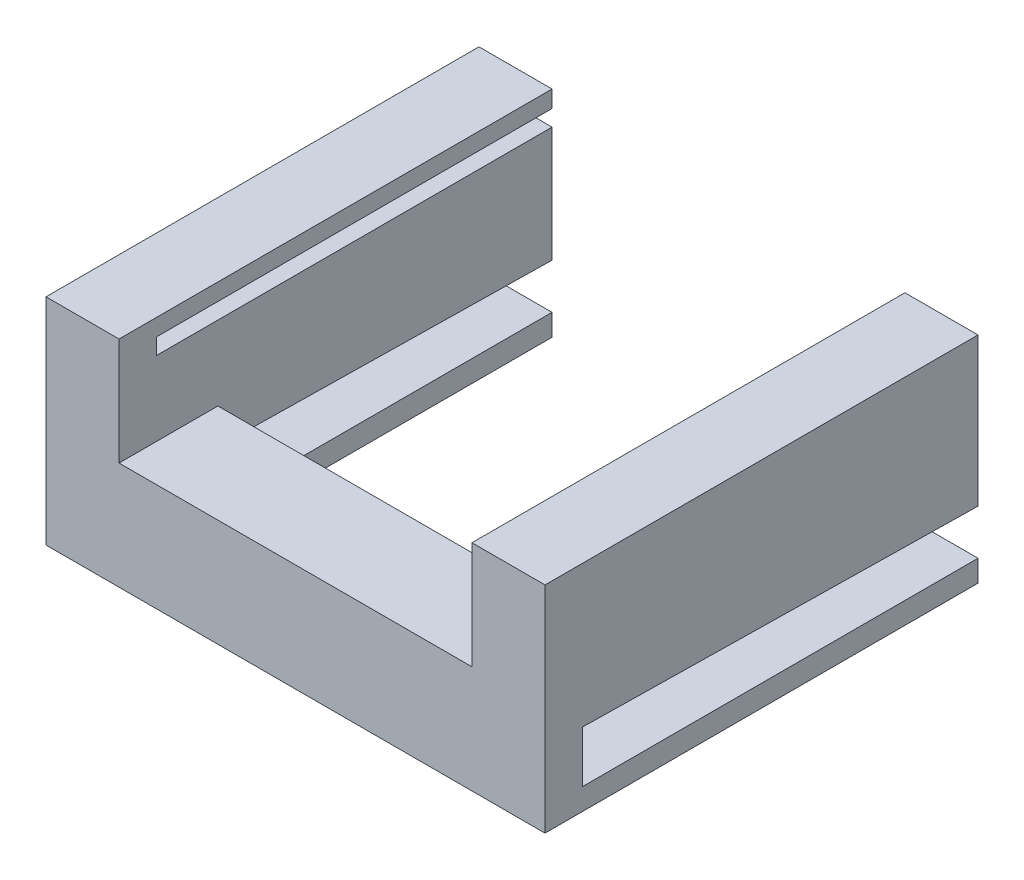
ISO-10303-21;
HEADER;
FILE_DESCRIPTION(('STEP AP214'),'2;1');
FILE_NAME('part.step','',(''),(''),'','','');
FILE_SCHEMA(('AUTOMOTIVE_DESIGN { 1 0 10303 214 1 1 1 1 }'));
ENDSEC;
DATA;
#1=APPLICATION_CONTEXT('core data for automotive mechanical design processes');
#2=APPLICATION_PROTOCOL_DEFINITION('international standard','automotive_design',2000,#1);
#3=PRODUCT_CONTEXT('',#1,'mechanical');
#4=PRODUCT('Part','Part','',(#3));
#5=PRODUCT_RELATED_PRODUCT_CATEGORY('part','',(#4));
#6=PRODUCT_DEFINITION_FORMATION('','',#4);
#7=PRODUCT_DEFINITION_CONTEXT('part definition',#1,'design');
#8=PRODUCT_DEFINITION('design','',#6,#7);
#9=PRODUCT_DEFINITION_SHAPE('','',#8);
#10=(LENGTH_UNIT() NAMED_UNIT(*) SI_UNIT(.MILLI.,.METRE.));
#11=(NAMED_UNIT(*) PLANE_ANGLE_UNIT() SI_UNIT($,.RADIAN.));
#12=(NAMED_UNIT(*) SI_UNIT($,.STERADIAN.) SOLID_ANGLE_UNIT());
#13=UNCERTAINTY_MEASURE_WITH_UNIT(LENGTH_MEASURE(1.E-05),#10,'distance_accuracy_value','');
#14=(GEOMETRIC_REPRESENTATION_CONTEXT(3) GLOBAL_UNCERTAINTY_ASSIGNED_CONTEXT((#13)) GLOBAL_UNIT_ASSIGNED_CONTEXT((#10,
#11,#12)) REPRESENTATION_CONTEXT('',''));
#15=CARTESIAN_POINT('',(0.,0.,0.));
#16=DIRECTION('',(0.,0.,1.));
#17=DIRECTION('',(1.,0.,0.));
#18=AXIS2_PLACEMENT_3D('',#15,#16,#17);
#19=CARTESIAN_POINT('',(0.,22.86,0.));
#20=DIRECTION('',(0.,1.,0.));
#21=DIRECTION('',(0.,0.,1.));
#22=AXIS2_PLACEMENT_3D('',#19,#20,#21);
#23=PLANE('',#22);
#24=DIRECTION('',(-1.,0.,0.));
#25=VECTOR('',#24,1.);
#26=CARTESIAN_POINT('',(0.,22.86,13.9095));
#27=LINE('',#26,#25);
#28=CARTESIAN_POINT('',(20.857,22.86,13.9095));
#29=VERTEX_POINT('',#28);
#30=CARTESIAN_POINT('',(-20.857,22.86,13.9095));
#31=VERTEX_POINT('',#30);
#32=EDGE_CURVE('E352',#29,#31,#27,.T.);
#33=ORIENTED_EDGE('',*,*,#32,.T.);
#34=DIRECTION('',(0.,0.,-1.));
#35=VECTOR('',#34,1.);
#36=CARTESIAN_POINT('',(-20.857,22.86,0.));
#37=LINE('',#36,#35);
#38=CARTESIAN_POINT('',(-20.857,22.86,25.5905));
#39=VERTEX_POINT('',#38);
#40=EDGE_CURVE('E451',#39,#31,#37,.T.);
#41=ORIENTED_EDGE('',*,*,#40,.F.);
#42=DIRECTION('',(-1.,0.,0.));
#43=VECTOR('',#42,1.);
#44=CARTESIAN_POINT('',(0.,22.86,25.5905));
#45=LINE('',#44,#43);
#46=CARTESIAN_POINT('',(20.857,22.86,25.5905));
#47=VERTEX_POINT('',#46);
#48=EDGE_CURVE('E356',#47,#39,#45,.T.);
#49=ORIENTED_EDGE('',*,*,#48,.F.);
#50=DIRECTION('',(0.,0.,-1.));
#51=VECTOR('',#50,1.);
#52=CARTESIAN_POINT('',(20.857,22.86,0.));
#53=LINE('',#52,#51);
#54=EDGE_CURVE('E472',#47,#29,#53,.T.);
#55=ORIENTED_EDGE('',*,*,#54,.T.);
#56=EDGE_LOOP('',(#33,#41,#49,#55));
#57=FACE_BOUND('',#56,.T.);
#58=ADVANCED_FACE('F40',(#57),#23,.T.);
#59=CARTESIAN_POINT('',(0.,22.86,-25.5905));
#60=DIRECTION('',(0.,0.,-1.));
#61=DIRECTION('',(-1.,0.,0.));
#62=AXIS2_PLACEMENT_3D('',#59,#60,#61);
#63=PLANE('',#62);
#64=DIRECTION('',(1.,0.,0.));
#65=VECTOR('',#64,1.);
#66=CARTESIAN_POINT('',(-29.493,10.1464620193215,-25.5905));
#67=LINE('',#66,#65);
#68=CARTESIAN_POINT('',(20.857,10.1464620193215,-25.5905));
#69=VERTEX_POINT('',#68);
#70=CARTESIAN_POINT('',(29.493,10.1464620193215,-25.5905));
#71=VERTEX_POINT('',#70);
#72=EDGE_CURVE('E225',#69,#71,#67,.T.);
#73=ORIENTED_EDGE('',*,*,#72,.F.);
#74=DIRECTION('',(0.,-1.,0.));
#75=VECTOR('',#74,1.);
#76=CARTESIAN_POINT('',(20.857,22.86,-25.5905));
#77=LINE('',#76,#75);
#78=CARTESIAN_POINT('',(20.857,12.7,-25.5905));
#79=VERTEX_POINT('',#78);
#80=EDGE_CURVE('E269',#79,#69,#77,.T.);
#81=ORIENTED_EDGE('',*,*,#80,.F.);
#82=DIRECTION('',(1.,0.,0.));
#83=VECTOR('',#82,1.);
#84=CARTESIAN_POINT('',(-29.493,12.7,-25.5905));
#85=LINE('',#84,#83);
#86=CARTESIAN_POINT('',(29.493,12.7,-25.5905));
#87=VERTEX_POINT('',#86);
#88=EDGE_CURVE('E507',#79,#87,#85,.T.);
#89=ORIENTED_EDGE('',*,*,#88,.T.);
#90=DIRECTION('',(0.,-1.,0.));
#91=VECTOR('',#90,1.);
#92=CARTESIAN_POINT('',(29.493,22.86,-25.5905));
#93=LINE('',#92,#91);
#94=EDGE_CURVE('E360',#87,#71,#93,.T.);
#95=ORIENTED_EDGE('',*,*,#94,.T.);
#96=EDGE_LOOP('',(#73,#81,#89,#95));
#97=FACE_BOUND('',#96,.T.);
#98=ADVANCED_FACE('F523',(#97),#63,.T.);
#99=CARTESIAN_POINT('',(20.857,22.86,0.));
#100=DIRECTION('',(1.,0.,0.));
#101=DIRECTION('',(0.,0.,-1.));
#102=AXIS2_PLACEMENT_3D('',#99,#100,#101);
#103=PLANE('',#102);
#104=ORIENTED_EDGE('',*,*,#80,.T.);
#105=DIRECTION('',(0.,0.,1.));
#106=VECTOR('',#105,1.);
#107=CARTESIAN_POINT('',(20.857,10.1464620193215,0.));
#108=LINE('',#107,#106);
#109=CARTESIAN_POINT('',(20.857,10.1464620193215,13.9095));
#110=VERTEX_POINT('',#109);
#111=EDGE_CURVE('E384',#69,#110,#108,.T.);
#112=ORIENTED_EDGE('',*,*,#111,.T.);
#113=DIRECTION('',(0.,-1.,0.));
#114=VECTOR('',#113,1.);
#115=CARTESIAN_POINT('',(20.857,22.86,13.9095));
#116=LINE('',#115,#114);
#117=CARTESIAN_POINT('',(20.857,12.7,13.9095));
#118=VERTEX_POINT('',#117);
#119=EDGE_CURVE('E264',#118,#110,#116,.T.);
#120=ORIENTED_EDGE('',*,*,#119,.F.);
#121=DIRECTION('',(0.,0.,-1.));
#122=VECTOR('',#121,1.);
#123=CARTESIAN_POINT('',(20.857,12.7,0.));
#124=LINE('',#123,#122);
#125=EDGE_CURVE('E348',#118,#79,#124,.T.);
#126=ORIENTED_EDGE('',*,*,#125,.T.);
#127=EDGE_LOOP('',(#104,#112,#120,#126));
#128=FACE_BOUND('',#127,.T.);
#129=ADVANCED_FACE('F525',(#128),#103,.F.);
#130=CARTESIAN_POINT('',(0.,22.86,13.9095));
#131=DIRECTION('',(0.,0.,1.));
#132=DIRECTION('',(1.,0.,0.));
#133=AXIS2_PLACEMENT_3D('',#130,#131,#132);
#134=PLANE('',#133);
#135=ORIENTED_EDGE('',*,*,#119,.T.);
#136=DIRECTION('',(-1.,0.,0.));
#137=VECTOR('',#136,1.);
#138=CARTESIAN_POINT('',(0.,10.1464620193215,13.9095));
#139=LINE('',#138,#137);
#140=CARTESIAN_POINT('',(-20.857,10.1464620193215,13.9095));
#141=VERTEX_POINT('',#140);
#142=EDGE_CURVE('E380',#110,#141,#139,.T.);
#143=ORIENTED_EDGE('',*,*,#142,.T.);
#144=DIRECTION('',(0.,-1.,0.));
#145=VECTOR('',#144,1.);
#146=CARTESIAN_POINT('',(-20.857,22.86,13.9095));
#147=LINE('',#146,#145);
#148=CARTESIAN_POINT('',(-20.857,12.7,13.9095));
#149=VERTEX_POINT('',#148);
#150=EDGE_CURVE('E258',#149,#141,#147,.T.);
#151=ORIENTED_EDGE('',*,*,#150,.F.);
#152=DIRECTION('',(1.,0.,0.));
#153=VECTOR('',#152,1.);
#154=CARTESIAN_POINT('',(0.,12.7,13.9095));
#155=LINE('',#154,#153);
#156=EDGE_CURVE('E344',#149,#118,#155,.T.);
#157=ORIENTED_EDGE('',*,*,#156,.T.);
#158=EDGE_LOOP('',(#135,#143,#151,#157));
#159=FACE_BOUND('',#158,.T.);
#160=ADVANCED_FACE('F530',(#159),#134,.F.);
#161=CARTESIAN_POINT('',(-20.857,22.86,0.));
#162=DIRECTION('',(1.,0.,0.));
#163=DIRECTION('',(0.,0.,-1.));
#164=AXIS2_PLACEMENT_3D('',#161,#162,#163);
#165=PLANE('',#164);
#166=DIRECTION('',(0.,0.,1.));
#167=VECTOR('',#166,1.);
#168=CARTESIAN_POINT('',(-20.857,10.1464620193215,0.));
#169=LINE('',#168,#167);
#170=CARTESIAN_POINT('',(-20.857,10.1464620193215,-25.5905));
#171=VERTEX_POINT('',#170);
#172=EDGE_CURVE('E388',#171,#141,#169,.T.);
#173=ORIENTED_EDGE('',*,*,#172,.F.);
#174=DIRECTION('',(0.,-1.,0.));
#175=VECTOR('',#174,1.);
#176=CARTESIAN_POINT('',(-20.857,22.86,-25.5905));
#177=LINE('',#176,#175);
#178=CARTESIAN_POINT('',(-20.857,12.7,-25.5905));
#179=VERTEX_POINT('',#178);
#180=EDGE_CURVE('E235',#179,#171,#177,.T.);
#181=ORIENTED_EDGE('',*,*,#180,.F.);
#182=DIRECTION('',(0.,0.,-1.));
#183=VECTOR('',#182,1.);
#184=CARTESIAN_POINT('',(-20.857,12.7,0.));
#185=LINE('',#184,#183);
#186=EDGE_CURVE('E321',#149,#179,#185,.T.);
#187=ORIENTED_EDGE('',*,*,#186,.F.);
#188=ORIENTED_EDGE('',*,*,#150,.T.);
#189=EDGE_LOOP('',(#173,#181,#187,#188));
#190=FACE_BOUND('',#189,.T.);
#191=ADVANCED_FACE('F532',(#190),#165,.T.);
#192=CARTESIAN_POINT('',(0.,22.86,-25.5905));
#193=DIRECTION('',(0.,0.,1.));
#194=DIRECTION('',(1.,0.,0.));
#195=AXIS2_PLACEMENT_3D('',#192,#193,#194);
#196=PLANE('',#195);
#197=ORIENTED_EDGE('',*,*,#180,.T.);
#198=CARTESIAN_POINT('',(-29.493,10.1464620193215,-25.5905));
#199=VERTEX_POINT('',#198);
#200=EDGE_CURVE('E217',#199,#171,#67,.T.);
#201=ORIENTED_EDGE('',*,*,#200,.F.);
#202=DIRECTION('',(0.,-1.,0.));
#203=VECTOR('',#202,1.);
#204=CARTESIAN_POINT('',(-29.493,22.86,-25.5905));
#205=LINE('',#204,#203);
#206=CARTESIAN_POINT('',(-29.493,12.7,-25.5905));
#207=VERTEX_POINT('',#206);
#208=EDGE_CURVE('E233',#207,#199,#205,.T.);
#209=ORIENTED_EDGE('',*,*,#208,.F.);
#210=EDGE_CURVE('E339',#207,#179,#85,.T.);
#211=ORIENTED_EDGE('',*,*,#210,.T.);
#212=EDGE_LOOP('',(#197,#201,#209,#211));
#213=FACE_BOUND('',#212,.T.);
#214=ADVANCED_FACE('F231',(#213),#196,.F.);
#215=DIRECTION('',(-1.,0.,0.));
#216=VECTOR('',#215,1.);
#217=CARTESIAN_POINT('',(24.765,31.66,-25.5905));
#218=LINE('',#217,#216);
#219=CARTESIAN_POINT('',(24.765,31.66,-25.5905));
#220=VERTEX_POINT('',#219);
#221=CARTESIAN_POINT('',(20.857,31.66,-25.5905));
#222=VERTEX_POINT('',#221);
#223=EDGE_CURVE('E402',#220,#222,#218,.T.);
#224=ORIENTED_EDGE('',*,*,#223,.F.);
#225=DIRECTION('',(0.,-1.,0.));
#226=VECTOR('',#225,1.);
#227=CARTESIAN_POINT('',(24.765,31.66,-25.5905));
#228=LINE('',#227,#226);
#229=CARTESIAN_POINT('',(24.765,33.56,-25.5905));
#230=VERTEX_POINT('',#229);
#231=EDGE_CURVE('E390',#230,#220,#228,.T.);
#232=ORIENTED_EDGE('',*,*,#231,.F.);
#233=DIRECTION('',(1.,0.,0.));
#234=VECTOR('',#233,1.);
#235=CARTESIAN_POINT('',(24.765,33.56,-25.5905));
#236=LINE('',#235,#234);
#237=CARTESIAN_POINT('',(20.857,33.56,-25.5905));
#238=VERTEX_POINT('',#237);
#239=EDGE_CURVE('E399',#238,#230,#236,.T.);
#240=ORIENTED_EDGE('',*,*,#239,.F.);
#241=CARTESIAN_POINT('',(20.857,35.56,-25.5905));
#242=VERTEX_POINT('',#241);
#243=EDGE_CURVE('E270',#242,#238,#77,.T.);
#244=ORIENTED_EDGE('',*,*,#243,.F.);
#245=DIRECTION('',(1.,0.,0.));
#246=VECTOR('',#245,1.);
#247=CARTESIAN_POINT('',(0.,35.56,-25.5905));
#248=LINE('',#247,#246);
#249=CARTESIAN_POINT('',(29.493,35.56,-25.5905));
#250=VERTEX_POINT('',#249);
#251=EDGE_CURVE('E475',#242,#250,#248,.T.);
#252=ORIENTED_EDGE('',*,*,#251,.T.);
#253=CARTESIAN_POINT('',(29.493,18.034,-25.5905));
#254=VERTEX_POINT('',#253);
#255=EDGE_CURVE('E325',#250,#254,#93,.T.);
#256=ORIENTED_EDGE('',*,*,#255,.T.);
#257=DIRECTION('',(1.,0.,0.));
#258=VECTOR('',#257,1.);
#259=CARTESIAN_POINT('',(-29.493,18.034,-25.5905));
#260=LINE('',#259,#258);
#261=CARTESIAN_POINT('',(20.857,18.034,-25.5905));
#262=VERTEX_POINT('',#261);
#263=EDGE_CURVE('E316',#262,#254,#260,.T.);
#264=ORIENTED_EDGE('',*,*,#263,.F.);
#265=EDGE_CURVE('E273',#222,#262,#77,.T.);
#266=ORIENTED_EDGE('',*,*,#265,.F.);
#267=EDGE_LOOP('',(#224,#232,#240,#244,#252,#256,#264,#266));
#268=FACE_BOUND('',#267,.T.);
#269=ADVANCED_FACE('F42',(#268),#63,.T.);
#270=DIRECTION('',(0.,-1.,0.));
#271=VECTOR('',#270,1.);
#272=CARTESIAN_POINT('',(20.857,22.86,21.1455));
#273=LINE('',#272,#271);
#274=CARTESIAN_POINT('',(20.857,33.56,21.1455));
#275=VERTEX_POINT('',#274);
#276=CARTESIAN_POINT('',(20.857,31.66,21.1455));
#277=VERTEX_POINT('',#276);
#278=EDGE_CURVE('E448',#275,#277,#273,.T.);
#279=ORIENTED_EDGE('',*,*,#278,.T.);
#280=DIRECTION('',(0.,0.,-1.));
#281=VECTOR('',#280,1.);
#282=CARTESIAN_POINT('',(20.857,31.66,0.));
#283=LINE('',#282,#281);
#284=EDGE_CURVE('E309',#277,#222,#283,.T.);
#285=ORIENTED_EDGE('',*,*,#284,.T.);
#286=ORIENTED_EDGE('',*,*,#265,.T.);
#287=DIRECTION('',(0.,0.0163021811513324,0.99986711061506));
#288=VECTOR('',#287,1.);
#289=CARTESIAN_POINT('',(20.857,18.4524080909494,0.0718629115606079));
#290=LINE('',#289,#288);
#291=CARTESIAN_POINT('',(20.857,18.6780217391304,13.9095));
#292=VERTEX_POINT('',#291);
#293=EDGE_CURVE('E308',#262,#292,#290,.T.);
#294=ORIENTED_EDGE('',*,*,#293,.T.);
#295=EDGE_CURVE('E265',#29,#292,#116,.T.);
#296=ORIENTED_EDGE('',*,*,#295,.F.);
#297=ORIENTED_EDGE('',*,*,#54,.F.);
#298=DIRECTION('',(0.,-1.,0.));
#299=VECTOR('',#298,1.);
#300=CARTESIAN_POINT('',(20.857,35.56,25.5905));
#301=LINE('',#300,#299);
#302=CARTESIAN_POINT('',(20.857,35.56,25.5905));
#303=VERTEX_POINT('',#302);
#304=EDGE_CURVE('E484',#303,#47,#301,.T.);
#305=ORIENTED_EDGE('',*,*,#304,.F.);
#306=DIRECTION('',(0.,0.,-1.));
#307=VECTOR('',#306,1.);
#308=CARTESIAN_POINT('',(20.857,35.56,0.));
#309=LINE('',#308,#307);
#310=EDGE_CURVE('E478',#303,#242,#309,.T.);
#311=ORIENTED_EDGE('',*,*,#310,.T.);
#312=ORIENTED_EDGE('',*,*,#243,.T.);
#313=DIRECTION('',(0.,0.,1.));
#314=VECTOR('',#313,1.);
#315=CARTESIAN_POINT('',(20.857,33.56,0.));
#316=LINE('',#315,#314);
#317=EDGE_CURVE('E440',#238,#275,#316,.T.);
#318=ORIENTED_EDGE('',*,*,#317,.T.);
#319=EDGE_LOOP('',(#279,#285,#286,#294,#296,#297,#305,#311,#312,#318));
#320=FACE_BOUND('',#319,.T.);
#321=ADVANCED_FACE('F306',(#320),#103,.F.);
#322=ORIENTED_EDGE('',*,*,#295,.T.);
#323=DIRECTION('',(-1.,0.,0.));
#324=VECTOR('',#323,1.);
#325=CARTESIAN_POINT('',(0.,18.6780217391304,13.9095));
#326=LINE('',#325,#324);
#327=CARTESIAN_POINT('',(-20.857,18.6780217391304,13.9095));
#328=VERTEX_POINT('',#327);
#329=EDGE_CURVE('E319',#292,#328,#326,.T.);
#330=ORIENTED_EDGE('',*,*,#329,.T.);
#331=EDGE_CURVE('E260',#31,#328,#147,.T.);
#332=ORIENTED_EDGE('',*,*,#331,.F.);
#333=ORIENTED_EDGE('',*,*,#32,.F.);
#334=EDGE_LOOP('',(#322,#330,#332,#333));
#335=FACE_BOUND('',#334,.T.);
#336=ADVANCED_FACE('F593',(#335),#134,.F.);
#337=DIRECTION('',(0.,0.,-1.));
#338=VECTOR('',#337,1.);
#339=CARTESIAN_POINT('',(-20.857,31.66,0.));
#340=LINE('',#339,#338);
#341=CARTESIAN_POINT('',(-20.857,31.66,21.1455));
#342=VERTEX_POINT('',#341);
#343=CARTESIAN_POINT('',(-20.857,31.66,-25.5905));
#344=VERTEX_POINT('',#343);
#345=EDGE_CURVE('E289',#342,#344,#340,.T.);
#346=ORIENTED_EDGE('',*,*,#345,.F.);
#347=DIRECTION('',(0.,-1.,0.));
#348=VECTOR('',#347,1.);
#349=CARTESIAN_POINT('',(-20.857,22.86,21.1455));
#350=LINE('',#349,#348);
#351=CARTESIAN_POINT('',(-20.857,33.56,21.1455));
#352=VERTEX_POINT('',#351);
#353=EDGE_CURVE('E11',#352,#342,#350,.T.);
#354=ORIENTED_EDGE('',*,*,#353,.F.);
#355=DIRECTION('',(0.,0.,1.));
#356=VECTOR('',#355,1.);
#357=CARTESIAN_POINT('',(-20.857,33.56,0.));
#358=LINE('',#357,#356);
#359=CARTESIAN_POINT('',(-20.857,33.56,-25.5905));
#360=VERTEX_POINT('',#359);
#361=EDGE_CURVE('E437',#360,#352,#358,.T.);
#362=ORIENTED_EDGE('',*,*,#361,.F.);
#363=CARTESIAN_POINT('',(-20.857,35.56,-25.5905));
#364=VERTEX_POINT('',#363);
#365=EDGE_CURVE('E254',#364,#360,#177,.T.);
#366=ORIENTED_EDGE('',*,*,#365,.F.);
#367=DIRECTION('',(0.,0.,-1.));
#368=VECTOR('',#367,1.);
#369=CARTESIAN_POINT('',(-20.857,35.56,0.));
#370=LINE('',#369,#368);
#371=CARTESIAN_POINT('',(-20.857,35.56,25.5905));
#372=VERTEX_POINT('',#371);
#373=EDGE_CURVE('E456',#372,#364,#370,.T.);
#374=ORIENTED_EDGE('',*,*,#373,.F.);
#375=DIRECTION('',(0.,-1.,0.));
#376=VECTOR('',#375,1.);
#377=CARTESIAN_POINT('',(-20.857,35.56,25.5905));
#378=LINE('',#377,#376);
#379=EDGE_CURVE('E467',#372,#39,#378,.T.);
#380=ORIENTED_EDGE('',*,*,#379,.T.);
#381=ORIENTED_EDGE('',*,*,#40,.T.);
#382=ORIENTED_EDGE('',*,*,#331,.T.);
#383=DIRECTION('',(0.,0.0163021811513324,0.99986711061506));
#384=VECTOR('',#383,1.);
#385=CARTESIAN_POINT('',(-20.857,18.4524080909494,0.0718629115606079));
#386=LINE('',#385,#384);
#387=CARTESIAN_POINT('',(-20.857,18.034,-25.5905));
#388=VERTEX_POINT('',#387);
#389=EDGE_CURVE('E290',#388,#328,#386,.T.);
#390=ORIENTED_EDGE('',*,*,#389,.F.);
#391=EDGE_CURVE('E259',#344,#388,#177,.T.);
#392=ORIENTED_EDGE('',*,*,#391,.F.);
#393=EDGE_LOOP('',(#346,#354,#362,#366,#374,#380,#381,#382,#390,#392));
#394=FACE_BOUND('',#393,.T.);
#395=ADVANCED_FACE('F287',(#394),#165,.T.);
#396=DIRECTION('',(0.,1.,0.));
#397=VECTOR('',#396,1.);
#398=CARTESIAN_POINT('',(-24.765,31.66,-25.5905));
#399=LINE('',#398,#397);
#400=CARTESIAN_POINT('',(-24.765,31.66,-25.5905));
#401=VERTEX_POINT('',#400);
#402=CARTESIAN_POINT('',(-24.765,33.56,-25.5905));
#403=VERTEX_POINT('',#402);
#404=EDGE_CURVE('E64',#401,#403,#399,.T.);
#405=ORIENTED_EDGE('',*,*,#404,.F.);
#406=DIRECTION('',(1.,0.,0.));
#407=VECTOR('',#406,1.);
#408=CARTESIAN_POINT('',(0.,31.66,-25.5905));
#409=LINE('',#408,#407);
#410=EDGE_CURVE('E49',#401,#344,#409,.T.);
#411=ORIENTED_EDGE('',*,*,#410,.T.);
#412=ORIENTED_EDGE('',*,*,#391,.T.);
#413=CARTESIAN_POINT('',(-29.493,18.034,-25.5905));
#414=VERTEX_POINT('',#413);
#415=EDGE_CURVE('E327',#414,#388,#260,.T.);
#416=ORIENTED_EDGE('',*,*,#415,.F.);
#417=CARTESIAN_POINT('',(-29.493,35.56,-25.5905));
#418=VERTEX_POINT('',#417);
#419=EDGE_CURVE('E244',#418,#414,#205,.T.);
#420=ORIENTED_EDGE('',*,*,#419,.F.);
#421=DIRECTION('',(1.,0.,0.));
#422=VECTOR('',#421,1.);
#423=CARTESIAN_POINT('',(0.,35.56,-25.5905));
#424=LINE('',#423,#422);
#425=EDGE_CURVE('E452',#418,#364,#424,.T.);
#426=ORIENTED_EDGE('',*,*,#425,.T.);
#427=ORIENTED_EDGE('',*,*,#365,.T.);
#428=EDGE_CURVE('E395',#403,#360,#236,.T.);
#429=ORIENTED_EDGE('',*,*,#428,.F.);
#430=EDGE_LOOP('',(#405,#411,#412,#416,#420,#426,#427,#429));
#431=FACE_BOUND('',#430,.T.);
#432=ADVANCED_FACE('F278',(#431),#196,.F.);
#433=CARTESIAN_POINT('',(-29.493,22.86,0.));
#434=DIRECTION('',(1.,0.,0.));
#435=DIRECTION('',(0.,0.,-1.));
#436=AXIS2_PLACEMENT_3D('',#433,#434,#435);
#437=PLANE('',#436);
#438=ORIENTED_EDGE('',*,*,#208,.T.);
#439=DIRECTION('',(0.,0.,1.));
#440=VECTOR('',#439,1.);
#441=CARTESIAN_POINT('',(-29.493,10.1464620193215,25.5905));
#442=LINE('',#441,#440);
#443=CARTESIAN_POINT('',(-29.493,10.1464620193215,25.5905));
#444=VERTEX_POINT('',#443);
#445=EDGE_CURVE('E214',#199,#444,#442,.T.);
#446=ORIENTED_EDGE('',*,*,#445,.T.);
#447=DIRECTION('',(0.,-1.,0.));
#448=VECTOR('',#447,1.);
#449=CARTESIAN_POINT('',(-29.493,22.86,25.5905));
#450=LINE('',#449,#448);
#451=CARTESIAN_POINT('',(-29.493,35.56,25.5905));
#452=VERTEX_POINT('',#451);
#453=EDGE_CURVE('E245',#452,#444,#450,.T.);
#454=ORIENTED_EDGE('',*,*,#453,.F.);
#455=DIRECTION('',(0.,0.,-1.));
#456=VECTOR('',#455,1.);
#457=CARTESIAN_POINT('',(-29.493,35.56,0.));
#458=LINE('',#457,#456);
#459=EDGE_CURVE('E463',#452,#418,#458,.T.);
#460=ORIENTED_EDGE('',*,*,#459,.T.);
#461=ORIENTED_EDGE('',*,*,#419,.T.);
#462=DIRECTION('',(0.,0.0163021811513324,0.99986711061506));
#463=VECTOR('',#462,1.);
#464=CARTESIAN_POINT('',(-29.493,18.796,21.1455));
#465=LINE('',#464,#463);
#466=CARTESIAN_POINT('',(-29.493,18.796,21.1455));
#467=VERTEX_POINT('',#466);
#468=EDGE_CURVE('E491',#414,#467,#465,.T.);
#469=ORIENTED_EDGE('',*,*,#468,.T.);
#470=DIRECTION('',(0.,-1.,0.));
#471=VECTOR('',#470,1.);
#472=CARTESIAN_POINT('',(-29.493,12.7,21.1455));
#473=LINE('',#472,#471);
#474=CARTESIAN_POINT('',(-29.493,12.7,21.1455));
#475=VERTEX_POINT('',#474);
#476=EDGE_CURVE('E332',#467,#475,#473,.T.);
#477=ORIENTED_EDGE('',*,*,#476,.T.);
#478=DIRECTION('',(0.,0.,-1.));
#479=VECTOR('',#478,1.);
#480=CARTESIAN_POINT('',(-29.493,12.7,-25.5905));
#481=LINE('',#480,#479);
#482=EDGE_CURVE('E242',#475,#207,#481,.T.);
#483=ORIENTED_EDGE('',*,*,#482,.T.);
#484=EDGE_LOOP('',(#438,#446,#454,#460,#461,#469,#477,#483));
#485=FACE_BOUND('',#484,.T.);
#486=ADVANCED_FACE('F239',(#485),#437,.F.);
#487=CARTESIAN_POINT('',(0.,22.86,25.5905));
#488=DIRECTION('',(0.,0.,1.));
#489=DIRECTION('',(1.,0.,0.));
#490=AXIS2_PLACEMENT_3D('',#487,#488,#489);
#491=PLANE('',#490);
#492=DIRECTION('',(1.,0.,0.));
#493=VECTOR('',#492,1.);
#494=CARTESIAN_POINT('',(-29.493,10.1464620193215,25.5905));
#495=LINE('',#494,#493);
#496=CARTESIAN_POINT('',(29.493,10.1464620193215,25.5905));
#497=VERTEX_POINT('',#496);
#498=EDGE_CURVE('E220',#444,#497,#495,.T.);
#499=ORIENTED_EDGE('',*,*,#498,.T.);
#500=DIRECTION('',(0.,-1.,0.));
#501=VECTOR('',#500,1.);
#502=CARTESIAN_POINT('',(29.493,22.86,25.5905));
#503=LINE('',#502,#501);
#504=CARTESIAN_POINT('',(29.493,35.56,25.5905));
#505=VERTEX_POINT('',#504);
#506=EDGE_CURVE('E250',#505,#497,#503,.T.);
#507=ORIENTED_EDGE('',*,*,#506,.F.);
#508=DIRECTION('',(-1.,0.,0.));
#509=VECTOR('',#508,1.);
#510=CARTESIAN_POINT('',(0.,35.56,25.5905));
#511=LINE('',#510,#509);
#512=EDGE_CURVE('E377',#505,#303,#511,.T.);
#513=ORIENTED_EDGE('',*,*,#512,.T.);
#514=ORIENTED_EDGE('',*,*,#304,.T.);
#515=ORIENTED_EDGE('',*,*,#48,.T.);
#516=ORIENTED_EDGE('',*,*,#379,.F.);
#517=DIRECTION('',(1.,0.,0.));
#518=VECTOR('',#517,1.);
#519=CARTESIAN_POINT('',(0.,35.56,25.5905));
#520=LINE('',#519,#518);
#521=EDGE_CURVE('E460',#452,#372,#520,.T.);
#522=ORIENTED_EDGE('',*,*,#521,.F.);
#523=ORIENTED_EDGE('',*,*,#453,.T.);
#524=EDGE_LOOP('',(#499,#507,#513,#514,#515,#516,#522,#523));
#525=FACE_BOUND('',#524,.T.);
#526=ADVANCED_FACE('F375',(#525),#491,.T.);
#527=CARTESIAN_POINT('',(29.493,22.86,0.));
#528=DIRECTION('',(1.,0.,0.));
#529=DIRECTION('',(0.,0.,-1.));
#530=AXIS2_PLACEMENT_3D('',#527,#528,#529);
#531=PLANE('',#530);
#532=DIRECTION('',(0.,0.,1.));
#533=VECTOR('',#532,1.);
#534=CARTESIAN_POINT('',(29.493,10.1464620193215,25.5905));
#535=LINE('',#534,#533);
#536=EDGE_CURVE('E226',#71,#497,#535,.T.);
#537=ORIENTED_EDGE('',*,*,#536,.F.);
#538=ORIENTED_EDGE('',*,*,#94,.F.);
#539=DIRECTION('',(0.,0.,-1.));
#540=VECTOR('',#539,1.);
#541=CARTESIAN_POINT('',(29.493,12.7,-25.5905));
#542=LINE('',#541,#540);
#543=CARTESIAN_POINT('',(29.493,12.7,21.1455));
#544=VERTEX_POINT('',#543);
#545=EDGE_CURVE('E495',#544,#87,#542,.T.);
#546=ORIENTED_EDGE('',*,*,#545,.F.);
#547=DIRECTION('',(0.,-1.,0.));
#548=VECTOR('',#547,1.);
#549=CARTESIAN_POINT('',(29.493,12.7,21.1455));
#550=LINE('',#549,#548);
#551=CARTESIAN_POINT('',(29.493,18.796,21.1455));
#552=VERTEX_POINT('',#551);
#553=EDGE_CURVE('E500',#552,#544,#550,.T.);
#554=ORIENTED_EDGE('',*,*,#553,.F.);
#555=DIRECTION('',(0.,0.0163021811513324,0.99986711061506));
#556=VECTOR('',#555,1.);
#557=CARTESIAN_POINT('',(29.493,18.796,21.1455));
#558=LINE('',#557,#556);
#559=EDGE_CURVE('E490',#254,#552,#558,.T.);
#560=ORIENTED_EDGE('',*,*,#559,.F.);
#561=ORIENTED_EDGE('',*,*,#255,.F.);
#562=DIRECTION('',(0.,0.,-1.));
#563=VECTOR('',#562,1.);
#564=CARTESIAN_POINT('',(29.493,35.56,0.));
#565=LINE('',#564,#563);
#566=EDGE_CURVE('E371',#505,#250,#565,.T.);
#567=ORIENTED_EDGE('',*,*,#566,.F.);
#568=ORIENTED_EDGE('',*,*,#506,.T.);
#569=EDGE_LOOP('',(#537,#538,#546,#554,#560,#561,#567,#568));
#570=FACE_BOUND('',#569,.T.);
#571=ADVANCED_FACE('F367',(#570),#531,.T.);
#572=CARTESIAN_POINT('',(-29.493,12.7,-25.5905));
#573=DIRECTION('',(0.,-1.,0.));
#574=DIRECTION('',(0.,0.,-1.));
#575=AXIS2_PLACEMENT_3D('',#572,#573,#574);
#576=PLANE('',#575);
#577=ORIENTED_EDGE('',*,*,#156,.F.);
#578=ORIENTED_EDGE('',*,*,#186,.T.);
#579=ORIENTED_EDGE('',*,*,#210,.F.);
#580=ORIENTED_EDGE('',*,*,#482,.F.);
#581=DIRECTION('',(1.,0.,0.));
#582=VECTOR('',#581,1.);
#583=CARTESIAN_POINT('',(-29.493,12.7,21.1455));
#584=LINE('',#583,#582);
#585=EDGE_CURVE('E508',#475,#544,#584,.T.);
#586=ORIENTED_EDGE('',*,*,#585,.T.);
#587=ORIENTED_EDGE('',*,*,#545,.T.);
#588=ORIENTED_EDGE('',*,*,#88,.F.);
#589=ORIENTED_EDGE('',*,*,#125,.F.);
#590=EDGE_LOOP('',(#577,#578,#579,#580,#586,#587,#588,#589));
#591=FACE_BOUND('',#590,.T.);
#592=ADVANCED_FACE('F519',(#591),#576,.F.);
#593=CARTESIAN_POINT('',(-29.493,18.796,21.1455));
#594=DIRECTION('',(0.,0.99986711061506,-0.0163021811513324));
#595=DIRECTION('',(0.,0.0163021811513324,0.99986711061506));
#596=AXIS2_PLACEMENT_3D('',#593,#594,#595);
#597=PLANE('',#596);
#598=ORIENTED_EDGE('',*,*,#263,.T.);
#599=ORIENTED_EDGE('',*,*,#559,.T.);
#600=DIRECTION('',(1.,0.,0.));
#601=VECTOR('',#600,1.);
#602=CARTESIAN_POINT('',(-29.493,18.796,21.1455));
#603=LINE('',#602,#601);
#604=EDGE_CURVE('E331',#467,#552,#603,.T.);
#605=ORIENTED_EDGE('',*,*,#604,.F.);
#606=ORIENTED_EDGE('',*,*,#468,.F.);
#607=ORIENTED_EDGE('',*,*,#415,.T.);
#608=ORIENTED_EDGE('',*,*,#389,.T.);
#609=ORIENTED_EDGE('',*,*,#329,.F.);
#610=ORIENTED_EDGE('',*,*,#293,.F.);
#611=EDGE_LOOP('',(#598,#599,#605,#606,#607,#608,#609,#610));
#612=FACE_BOUND('',#611,.T.);
#613=ADVANCED_FACE('F314',(#612),#597,.F.);
#614=CARTESIAN_POINT('',(-29.493,12.7,21.1455));
#615=DIRECTION('',(0.,0.,1.));
#616=DIRECTION('',(1.,0.,0.));
#617=AXIS2_PLACEMENT_3D('',#614,#615,#616);
#618=PLANE('',#617);
#619=ORIENTED_EDGE('',*,*,#553,.T.);
#620=ORIENTED_EDGE('',*,*,#585,.F.);
#621=ORIENTED_EDGE('',*,*,#476,.F.);
#622=ORIENTED_EDGE('',*,*,#604,.T.);
#623=EDGE_LOOP('',(#619,#620,#621,#622));
#624=FACE_BOUND('',#623,.T.);
#625=ADVANCED_FACE('F516',(#624),#618,.F.);
#626=CARTESIAN_POINT('',(0.,35.56,0.));
#627=DIRECTION('',(0.,-1.,0.));
#628=DIRECTION('',(0.,0.,-1.));
#629=AXIS2_PLACEMENT_3D('',#626,#627,#628);
#630=PLANE('',#629);
#631=ORIENTED_EDGE('',*,*,#566,.T.);
#632=ORIENTED_EDGE('',*,*,#251,.F.);
#633=ORIENTED_EDGE('',*,*,#310,.F.);
#634=ORIENTED_EDGE('',*,*,#512,.F.);
#635=EDGE_LOOP('',(#631,#632,#633,#634));
#636=FACE_BOUND('',#635,.T.);
#637=ADVANCED_FACE('F565',(#636),#630,.F.);
#638=CARTESIAN_POINT('',(0.,35.56,0.));
#639=DIRECTION('',(0.,1.,0.));
#640=DIRECTION('',(0.,0.,1.));
#641=AXIS2_PLACEMENT_3D('',#638,#639,#640);
#642=PLANE('',#641);
#643=ORIENTED_EDGE('',*,*,#425,.F.);
#644=ORIENTED_EDGE('',*,*,#459,.F.);
#645=ORIENTED_EDGE('',*,*,#521,.T.);
#646=ORIENTED_EDGE('',*,*,#373,.T.);
#647=EDGE_LOOP('',(#643,#644,#645,#646));
#648=FACE_BOUND('',#647,.T.);
#649=ADVANCED_FACE('F536',(#648),#642,.T.);
#650=CARTESIAN_POINT('',(24.765,33.56,70.7119291632956));
#651=DIRECTION('',(0.,1.,0.));
#652=DIRECTION('',(-1.,0.,0.));
#653=AXIS2_PLACEMENT_3D('',#650,#651,#652);
#654=PLANE('',#653);
#655=ORIENTED_EDGE('',*,*,#361,.T.);
#656=DIRECTION('',(1.,0.,0.));
#657=VECTOR('',#656,1.);
#658=CARTESIAN_POINT('',(24.765,33.56,21.1455));
#659=LINE('',#658,#657);
#660=CARTESIAN_POINT('',(-24.765,33.56,21.1455));
#661=VERTEX_POINT('',#660);
#662=EDGE_CURVE('E419',#661,#352,#659,.T.);
#663=ORIENTED_EDGE('',*,*,#662,.F.);
#664=DIRECTION('',(0.,0.,-1.));
#665=VECTOR('',#664,1.);
#666=CARTESIAN_POINT('',(-24.765,33.56,70.7119291632956));
#667=LINE('',#666,#665);
#668=EDGE_CURVE('E427',#661,#403,#667,.T.);
#669=ORIENTED_EDGE('',*,*,#668,.T.);
#670=ORIENTED_EDGE('',*,*,#428,.T.);
#671=EDGE_LOOP('',(#655,#663,#669,#670));
#672=FACE_BOUND('',#671,.T.);
#673=ADVANCED_FACE('F542',(#672),#654,.F.);
#674=CARTESIAN_POINT('',(-24.765,31.66,70.7119291632956));
#675=DIRECTION('',(-1.,0.,0.));
#676=DIRECTION('',(0.,0.,1.));
#677=AXIS2_PLACEMENT_3D('',#674,#675,#676);
#678=PLANE('',#677);
#679=DIRECTION('',(0.,0.,-1.));
#680=VECTOR('',#679,1.);
#681=CARTESIAN_POINT('',(-24.765,31.66,70.7119291632956));
#682=LINE('',#681,#680);
#683=CARTESIAN_POINT('',(-24.765,31.66,21.1455));
#684=VERTEX_POINT('',#683);
#685=EDGE_CURVE('E412',#684,#401,#682,.T.);
#686=ORIENTED_EDGE('',*,*,#685,.T.);
#687=ORIENTED_EDGE('',*,*,#404,.T.);
#688=ORIENTED_EDGE('',*,*,#668,.F.);
#689=DIRECTION('',(0.,1.,0.));
#690=VECTOR('',#689,1.);
#691=CARTESIAN_POINT('',(-24.765,31.66,21.1455));
#692=LINE('',#691,#690);
#693=EDGE_CURVE('E423',#684,#661,#692,.T.);
#694=ORIENTED_EDGE('',*,*,#693,.F.);
#695=EDGE_LOOP('',(#686,#687,#688,#694));
#696=FACE_BOUND('',#695,.T.);
#697=ADVANCED_FACE('F544',(#696),#678,.F.);
#698=CARTESIAN_POINT('',(24.765,31.66,70.7119291632956));
#699=DIRECTION('',(0.,-1.,0.));
#700=DIRECTION('',(1.,0.,0.));
#701=AXIS2_PLACEMENT_3D('',#698,#699,#700);
#702=PLANE('',#701);
#703=ORIENTED_EDGE('',*,*,#345,.T.);
#704=ORIENTED_EDGE('',*,*,#410,.F.);
#705=ORIENTED_EDGE('',*,*,#685,.F.);
#706=DIRECTION('',(-1.,0.,0.));
#707=VECTOR('',#706,1.);
#708=CARTESIAN_POINT('',(24.765,31.66,21.1455));
#709=LINE('',#708,#707);
#710=EDGE_CURVE('E398',#342,#684,#709,.T.);
#711=ORIENTED_EDGE('',*,*,#710,.F.);
#712=EDGE_LOOP('',(#703,#704,#705,#711));
#713=FACE_BOUND('',#712,.T.);
#714=ADVANCED_FACE('F659',(#713),#702,.F.);
#715=CARTESIAN_POINT('',(-29.493,12.7,21.1455));
#716=DIRECTION('',(0.,0.,1.));
#717=DIRECTION('',(1.,0.,0.));
#718=AXIS2_PLACEMENT_3D('',#715,#716,#717);
#719=PLANE('',#718);
#720=ORIENTED_EDGE('',*,*,#353,.T.);
#721=ORIENTED_EDGE('',*,*,#710,.T.);
#722=ORIENTED_EDGE('',*,*,#693,.T.);
#723=ORIENTED_EDGE('',*,*,#662,.T.);
#724=EDGE_LOOP('',(#720,#721,#722,#723));
#725=FACE_BOUND('',#724,.T.);
#726=ADVANCED_FACE('F546',(#725),#719,.F.);
#727=CARTESIAN_POINT('',(24.765,33.56,21.1455));
#728=VERTEX_POINT('',#727);
#729=EDGE_CURVE('E56',#275,#728,#659,.T.);
#730=ORIENTED_EDGE('',*,*,#729,.T.);
#731=DIRECTION('',(0.,-1.,0.));
#732=VECTOR('',#731,1.);
#733=CARTESIAN_POINT('',(24.765,31.66,21.1455));
#734=LINE('',#733,#732);
#735=CARTESIAN_POINT('',(24.765,31.66,21.1455));
#736=VERTEX_POINT('',#735);
#737=EDGE_CURVE('E413',#728,#736,#734,.T.);
#738=ORIENTED_EDGE('',*,*,#737,.T.);
#739=EDGE_CURVE('E408',#736,#277,#709,.T.);
#740=ORIENTED_EDGE('',*,*,#739,.T.);
#741=ORIENTED_EDGE('',*,*,#278,.F.);
#742=EDGE_LOOP('',(#730,#738,#740,#741));
#743=FACE_BOUND('',#742,.T.);
#744=ADVANCED_FACE('F560',(#743),#719,.F.);
#745=ORIENTED_EDGE('',*,*,#739,.F.);
#746=DIRECTION('',(0.,0.,-1.));
#747=VECTOR('',#746,1.);
#748=CARTESIAN_POINT('',(24.765,31.66,70.7119291632956));
#749=LINE('',#748,#747);
#750=EDGE_CURVE('E417',#736,#220,#749,.T.);
#751=ORIENTED_EDGE('',*,*,#750,.T.);
#752=ORIENTED_EDGE('',*,*,#223,.T.);
#753=ORIENTED_EDGE('',*,*,#284,.F.);
#754=EDGE_LOOP('',(#745,#751,#752,#753));
#755=FACE_BOUND('',#754,.T.);
#756=ADVANCED_FACE('F558',(#755),#702,.F.);
#757=ORIENTED_EDGE('',*,*,#239,.T.);
#758=DIRECTION('',(0.,0.,-1.));
#759=VECTOR('',#758,1.);
#760=CARTESIAN_POINT('',(24.765,33.56,70.7119291632956));
#761=LINE('',#760,#759);
#762=EDGE_CURVE('E418',#728,#230,#761,.T.);
#763=ORIENTED_EDGE('',*,*,#762,.F.);
#764=ORIENTED_EDGE('',*,*,#729,.F.);
#765=ORIENTED_EDGE('',*,*,#317,.F.);
#766=EDGE_LOOP('',(#757,#763,#764,#765));
#767=FACE_BOUND('',#766,.T.);
#768=ADVANCED_FACE('F551',(#767),#654,.F.);
#769=CARTESIAN_POINT('',(24.765,31.66,70.7119291632956));
#770=DIRECTION('',(1.,0.,0.));
#771=DIRECTION('',(0.,0.,-1.));
#772=AXIS2_PLACEMENT_3D('',#769,#770,#771);
#773=PLANE('',#772);
#774=ORIENTED_EDGE('',*,*,#762,.T.);
#775=ORIENTED_EDGE('',*,*,#231,.T.);
#776=ORIENTED_EDGE('',*,*,#750,.F.);
#777=ORIENTED_EDGE('',*,*,#737,.F.);
#778=EDGE_LOOP('',(#774,#775,#776,#777));
#779=FACE_BOUND('',#778,.T.);
#780=ADVANCED_FACE('F555',(#779),#773,.F.);
#781=CARTESIAN_POINT('',(-29.493,10.1464620193215,25.5905));
#782=DIRECTION('',(0.,1.,0.));
#783=DIRECTION('',(0.,0.,1.));
#784=AXIS2_PLACEMENT_3D('',#781,#782,#783);
#785=PLANE('',#784);
#786=ORIENTED_EDGE('',*,*,#536,.T.);
#787=ORIENTED_EDGE('',*,*,#498,.F.);
#788=ORIENTED_EDGE('',*,*,#445,.F.);
#789=ORIENTED_EDGE('',*,*,#200,.T.);
#790=ORIENTED_EDGE('',*,*,#172,.T.);
#791=ORIENTED_EDGE('',*,*,#142,.F.);
#792=ORIENTED_EDGE('',*,*,#111,.F.);
#793=ORIENTED_EDGE('',*,*,#72,.T.);
#794=EDGE_LOOP('',(#786,#787,#788,#789,#790,#791,#792,#793));
#795=FACE_BOUND('',#794,.T.);
#796=ADVANCED_FACE('F216',(#795),#785,.F.);
#797=CLOSED_SHELL('',(#58,#98,#129,#160,#191,#214,#269,#321,#336,#395,#432,#486,#526,#571,#592,
#613,#625,#637,#649,#673,#697,#714,#726,#744,#756,#768,#780,#796));
#798=MANIFOLD_SOLID_BREP('B2',#797);
#799=ADVANCED_BREP_SHAPE_REPRESENTATION('',(#18,#798),#14);
#800=SHAPE_DEFINITION_REPRESENTATION(#9,#799);
ENDSEC;
END-ISO-10303-21;
